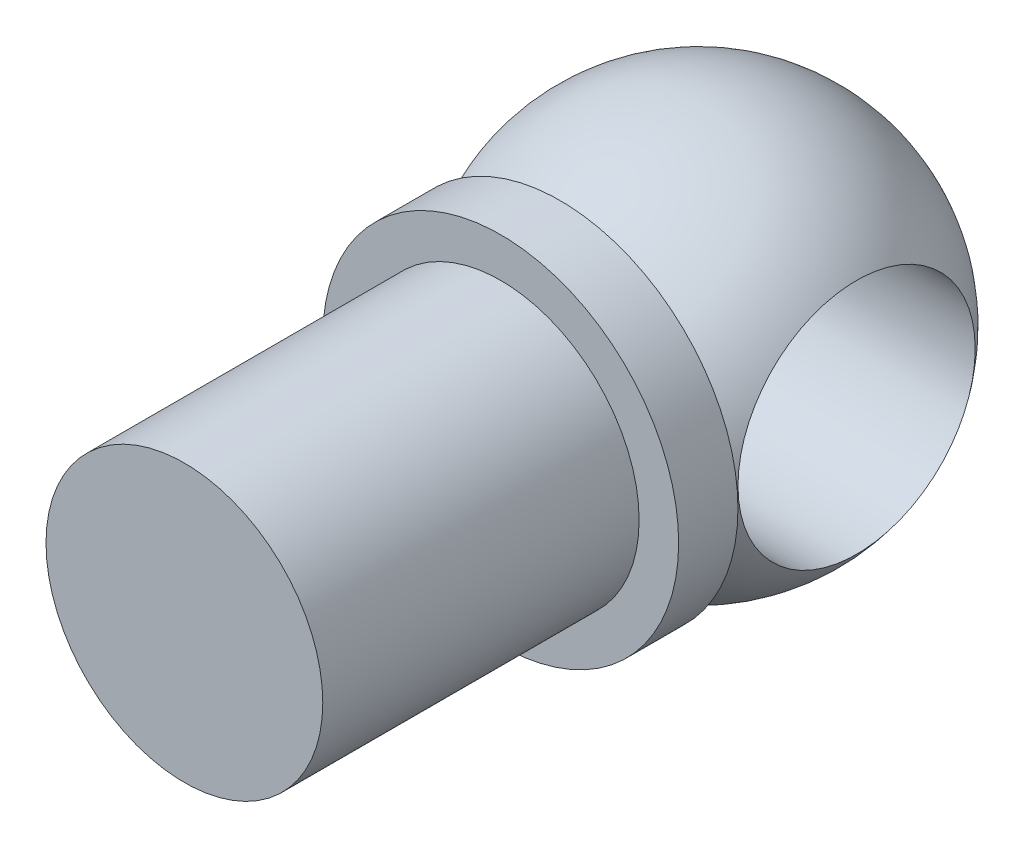
ISO-10303-21;
HEADER;
FILE_DESCRIPTION(('STEP AP214'),'2;1');
FILE_NAME('part.step','',(''),(''),'','','');
FILE_SCHEMA(('AUTOMOTIVE_DESIGN { 1 0 10303 214 1 1 1 1 }'));
ENDSEC;
DATA;
#1=APPLICATION_CONTEXT('core data for automotive mechanical design processes');
#2=APPLICATION_PROTOCOL_DEFINITION('international standard','automotive_design',2000,#1);
#3=PRODUCT_CONTEXT('',#1,'mechanical');
#4=PRODUCT('Part','Part','',(#3));
#5=PRODUCT_RELATED_PRODUCT_CATEGORY('part','',(#4));
#6=PRODUCT_DEFINITION_FORMATION('','',#4);
#7=PRODUCT_DEFINITION_CONTEXT('part definition',#1,'design');
#8=PRODUCT_DEFINITION('design','',#6,#7);
#9=PRODUCT_DEFINITION_SHAPE('','',#8);
#10=(LENGTH_UNIT() NAMED_UNIT(*) SI_UNIT(.MILLI.,.METRE.));
#11=(NAMED_UNIT(*) PLANE_ANGLE_UNIT() SI_UNIT($,.RADIAN.));
#12=(NAMED_UNIT(*) SI_UNIT($,.STERADIAN.) SOLID_ANGLE_UNIT());
#13=UNCERTAINTY_MEASURE_WITH_UNIT(LENGTH_MEASURE(1.E-05),#10,'distance_accuracy_value','');
#14=(GEOMETRIC_REPRESENTATION_CONTEXT(3) GLOBAL_UNCERTAINTY_ASSIGNED_CONTEXT((#13)) GLOBAL_UNIT_ASSIGNED_CONTEXT((#10,
#11,#12)) REPRESENTATION_CONTEXT('',''));
#15=CARTESIAN_POINT('',(0.,0.,0.));
#16=DIRECTION('',(0.,0.,1.));
#17=DIRECTION('',(1.,0.,0.));
#18=AXIS2_PLACEMENT_3D('',#15,#16,#17);
#19=CARTESIAN_POINT('',(0.,0.,0.));
#20=DIRECTION('',(0.,0.,-1.));
#21=DIRECTION('',(1.,0.,0.));
#22=AXIS2_PLACEMENT_3D('',#19,#20,#21);
#23=SPHERICAL_SURFACE('',#22,5.);
#24=CARTESIAN_POINT('',(-4.,0.,0.));
#25=DIRECTION('',(1.,0.,0.));
#26=DIRECTION('',(0.,0.,-1.));
#27=AXIS2_PLACEMENT_3D('',#24,#25,#26);
#28=CIRCLE('',#27,3.);
#29=CARTESIAN_POINT('',(-4.,0.,-3.));
#30=VERTEX_POINT('',#29);
#31=EDGE_CURVE('E46',#30,#30,#28,.T.);
#32=ORIENTED_EDGE('',*,*,#31,.T.);
#33=EDGE_LOOP('',(#32));
#34=FACE_BOUND('',#33,.T.);
#35=CARTESIAN_POINT('',(4.,0.,0.));
#36=DIRECTION('',(-1.,0.,0.));
#37=DIRECTION('',(0.,0.,1.));
#38=AXIS2_PLACEMENT_3D('',#35,#36,#37);
#39=CIRCLE('',#38,3.);
#40=CARTESIAN_POINT('',(4.,0.,3.));
#41=VERTEX_POINT('',#40);
#42=EDGE_CURVE('E51',#41,#41,#39,.T.);
#43=ORIENTED_EDGE('',*,*,#42,.T.);
#44=EDGE_LOOP('',(#43));
#45=FACE_BOUND('',#44,.T.);
#46=CARTESIAN_POINT('',(0.,0.,3.5));
#47=DIRECTION('',(0.,0.,1.));
#48=DIRECTION('',(1.,0.,0.));
#49=AXIS2_PLACEMENT_3D('',#46,#47,#48);
#50=CIRCLE('',#49,3.57071421427142);
#51=CARTESIAN_POINT('',(3.57071421427142,0.,3.5));
#52=VERTEX_POINT('',#51);
#53=EDGE_CURVE('E42',#52,#52,#50,.F.);
#54=ORIENTED_EDGE('',*,*,#53,.T.);
#55=EDGE_LOOP('',(#54));
#56=FACE_BOUND('',#55,.T.);
#57=ADVANCED_FACE('F39',(#34,#45,#56),#23,.T.);
#58=CARTESIAN_POINT('',(13.,0.,0.));
#59=DIRECTION('',(-1.,0.,0.));
#60=DIRECTION('',(0.,0.,1.));
#61=AXIS2_PLACEMENT_3D('',#58,#59,#60);
#62=CYLINDRICAL_SURFACE('',#61,3.);
#63=ORIENTED_EDGE('',*,*,#31,.F.);
#64=EDGE_LOOP('',(#63));
#65=FACE_BOUND('',#64,.T.);
#66=ORIENTED_EDGE('',*,*,#42,.F.);
#67=EDGE_LOOP('',(#66));
#68=FACE_BOUND('',#67,.T.);
#69=ADVANCED_FACE('F75',(#65,#68),#62,.F.);
#70=CARTESIAN_POINT('',(0.,0.,3.5));
#71=DIRECTION('',(0.,0.,1.));
#72=DIRECTION('',(1.,0.,0.));
#73=AXIS2_PLACEMENT_3D('',#70,#71,#72);
#74=CYLINDRICAL_SURFACE('',#73,4.5);
#75=CARTESIAN_POINT('',(0.,0.,3.5));
#76=DIRECTION('',(0.,0.,1.));
#77=DIRECTION('',(1.,0.,0.));
#78=AXIS2_PLACEMENT_3D('',#75,#76,#77);
#79=CIRCLE('',#78,4.5);
#80=CARTESIAN_POINT('',(4.5,0.,3.5));
#81=VERTEX_POINT('',#80);
#82=EDGE_CURVE('E60',#81,#81,#79,.T.);
#83=ORIENTED_EDGE('',*,*,#82,.T.);
#84=EDGE_LOOP('',(#83));
#85=FACE_BOUND('',#84,.T.);
#86=CARTESIAN_POINT('',(0.,0.,5.));
#87=DIRECTION('',(0.,0.,1.));
#88=DIRECTION('',(1.,0.,0.));
#89=AXIS2_PLACEMENT_3D('',#86,#87,#88);
#90=CIRCLE('',#89,4.5);
#91=CARTESIAN_POINT('',(4.5,0.,5.));
#92=VERTEX_POINT('',#91);
#93=EDGE_CURVE('E55',#92,#92,#90,.T.);
#94=ORIENTED_EDGE('',*,*,#93,.F.);
#95=EDGE_LOOP('',(#94));
#96=FACE_BOUND('',#95,.T.);
#97=ADVANCED_FACE('F72',(#85,#96),#74,.T.);
#98=CARTESIAN_POINT('',(0.,0.,3.5));
#99=DIRECTION('',(0.,0.,1.));
#100=DIRECTION('',(1.,0.,0.));
#101=AXIS2_PLACEMENT_3D('',#98,#99,#100);
#102=PLANE('',#101);
#103=ORIENTED_EDGE('',*,*,#53,.F.);
#104=EDGE_LOOP('',(#103));
#105=FACE_BOUND('',#104,.T.);
#106=ORIENTED_EDGE('',*,*,#82,.F.);
#107=EDGE_LOOP('',(#106));
#108=FACE_BOUND('',#107,.T.);
#109=ADVANCED_FACE('F74',(#105,#108),#102,.F.);
#110=CARTESIAN_POINT('',(0.,0.,5.));
#111=DIRECTION('',(0.,0.,1.));
#112=DIRECTION('',(1.,0.,0.));
#113=AXIS2_PLACEMENT_3D('',#110,#111,#112);
#114=PLANE('',#113);
#115=CARTESIAN_POINT('',(0.,0.,5.));
#116=DIRECTION('',(0.,0.,1.));
#117=DIRECTION('',(1.,0.,0.));
#118=AXIS2_PLACEMENT_3D('',#115,#116,#117);
#119=CIRCLE('',#118,3.5);
#120=CARTESIAN_POINT('',(3.5,0.,5.));
#121=VERTEX_POINT('',#120);
#122=EDGE_CURVE('E58',#121,#121,#119,.T.);
#123=ORIENTED_EDGE('',*,*,#122,.F.);
#124=EDGE_LOOP('',(#123));
#125=FACE_BOUND('',#124,.T.);
#126=ORIENTED_EDGE('',*,*,#93,.T.);
#127=EDGE_LOOP('',(#126));
#128=FACE_BOUND('',#127,.T.);
#129=ADVANCED_FACE('F70',(#125,#128),#114,.T.);
#130=CARTESIAN_POINT('',(0.,0.,13.));
#131=DIRECTION('',(0.,0.,1.));
#132=DIRECTION('',(1.,0.,0.));
#133=AXIS2_PLACEMENT_3D('',#130,#131,#132);
#134=PLANE('',#133);
#135=CARTESIAN_POINT('',(0.,0.,13.));
#136=DIRECTION('',(0.,0.,1.));
#137=DIRECTION('',(1.,0.,0.));
#138=AXIS2_PLACEMENT_3D('',#135,#136,#137);
#139=CIRCLE('',#138,3.5);
#140=CARTESIAN_POINT('',(3.5,0.,13.));
#141=VERTEX_POINT('',#140);
#142=EDGE_CURVE('E10',#141,#141,#139,.T.);
#143=ORIENTED_EDGE('',*,*,#142,.T.);
#144=EDGE_LOOP('',(#143));
#145=FACE_BOUND('',#144,.T.);
#146=ADVANCED_FACE('F119',(#145),#134,.T.);
#147=CARTESIAN_POINT('',(0.,0.,13.));
#148=DIRECTION('',(0.,0.,-1.));
#149=DIRECTION('',(-1.,0.,0.));
#150=AXIS2_PLACEMENT_3D('',#147,#148,#149);
#151=CYLINDRICAL_SURFACE('',#150,3.5);
#152=ORIENTED_EDGE('',*,*,#122,.T.);
#153=EDGE_LOOP('',(#152));
#154=FACE_BOUND('',#153,.T.);
#155=ORIENTED_EDGE('',*,*,#142,.F.);
#156=EDGE_LOOP('',(#155));
#157=FACE_BOUND('',#156,.T.);
#158=ADVANCED_FACE('F124',(#154,#157),#151,.T.);
#159=CLOSED_SHELL('',(#57,#69,#97,#109,#129,#146,#158));
#160=MANIFOLD_SOLID_BREP('B2',#159);
#161=ADVANCED_BREP_SHAPE_REPRESENTATION('',(#18,#160),#14);
#162=SHAPE_DEFINITION_REPRESENTATION(#9,#161);
ENDSEC;
END-ISO-10303-21;
